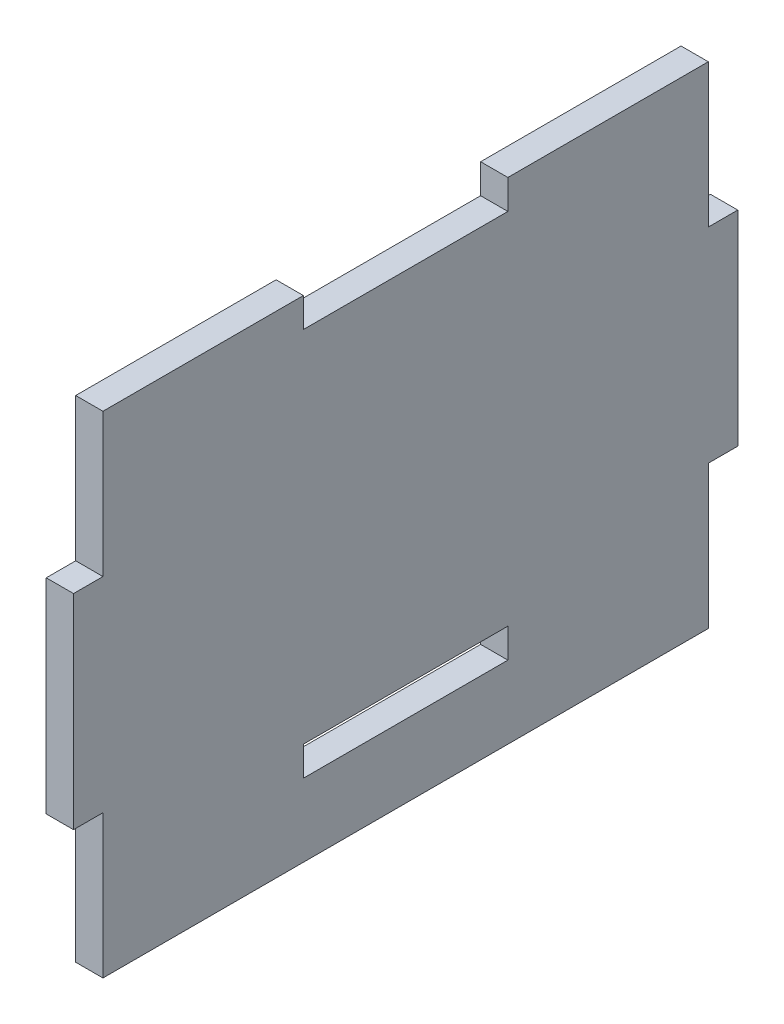
ISO-10303-21;
HEADER;
FILE_DESCRIPTION(('STEP AP214'),'2;1');
FILE_NAME('part.step','',(''),(''),'','','');
FILE_SCHEMA(('AUTOMOTIVE_DESIGN { 1 0 10303 214 1 1 1 1 }'));
ENDSEC;
DATA;
#1=APPLICATION_CONTEXT('core data for automotive mechanical design processes');
#2=APPLICATION_PROTOCOL_DEFINITION('international standard','automotive_design',2000,#1);
#3=PRODUCT_CONTEXT('',#1,'mechanical');
#4=PRODUCT('Part','Part','',(#3));
#5=PRODUCT_RELATED_PRODUCT_CATEGORY('part','',(#4));
#6=PRODUCT_DEFINITION_FORMATION('','',#4);
#7=PRODUCT_DEFINITION_CONTEXT('part definition',#1,'design');
#8=PRODUCT_DEFINITION('design','',#6,#7);
#9=PRODUCT_DEFINITION_SHAPE('','',#8);
#10=(LENGTH_UNIT() NAMED_UNIT(*) SI_UNIT(.MILLI.,.METRE.));
#11=(NAMED_UNIT(*) PLANE_ANGLE_UNIT() SI_UNIT($,.RADIAN.));
#12=(NAMED_UNIT(*) SI_UNIT($,.STERADIAN.) SOLID_ANGLE_UNIT());
#13=UNCERTAINTY_MEASURE_WITH_UNIT(LENGTH_MEASURE(1.E-05),#10,'distance_accuracy_value','');
#14=(GEOMETRIC_REPRESENTATION_CONTEXT(3) GLOBAL_UNCERTAINTY_ASSIGNED_CONTEXT((#13)) GLOBAL_UNIT_ASSIGNED_CONTEXT((#10,
#11,#12)) REPRESENTATION_CONTEXT('',''));
#15=CARTESIAN_POINT('',(0.,0.,0.));
#16=DIRECTION('',(0.,0.,1.));
#17=DIRECTION('',(1.,0.,0.));
#18=AXIS2_PLACEMENT_3D('',#15,#16,#17);
#19=CARTESIAN_POINT('',(2.54,22.86,-28.194));
#20=DIRECTION('',(0.,-1.,0.));
#21=DIRECTION('',(0.,0.,-1.));
#22=AXIS2_PLACEMENT_3D('',#19,#20,#21);
#23=PLANE('',#22);
#24=DIRECTION('',(0.,0.,1.));
#25=VECTOR('',#24,1.);
#26=CARTESIAN_POINT('',(0.,22.86,-28.194));
#27=LINE('',#26,#25);
#28=CARTESIAN_POINT('',(0.,22.86,-28.194));
#29=VERTEX_POINT('',#28);
#30=CARTESIAN_POINT('',(0.,22.86,-9.52499999999999));
#31=VERTEX_POINT('',#30);
#32=EDGE_CURVE('E186',#29,#31,#27,.T.);
#33=ORIENTED_EDGE('',*,*,#32,.T.);
#34=DIRECTION('',(1.,0.,0.));
#35=VECTOR('',#34,1.);
#36=CARTESIAN_POINT('',(0.,22.86,-9.52499999999999));
#37=LINE('',#36,#35);
#38=CARTESIAN_POINT('',(2.54,22.86,-9.52499999999999));
#39=VERTEX_POINT('',#38);
#40=EDGE_CURVE('E170',#31,#39,#37,.T.);
#41=ORIENTED_EDGE('',*,*,#40,.T.);
#42=DIRECTION('',(0.,0.,1.));
#43=VECTOR('',#42,1.);
#44=CARTESIAN_POINT('',(2.54,22.86,-28.194));
#45=LINE('',#44,#43);
#46=CARTESIAN_POINT('',(2.54,22.86,-28.194));
#47=VERTEX_POINT('',#46);
#48=EDGE_CURVE('E206',#47,#39,#45,.T.);
#49=ORIENTED_EDGE('',*,*,#48,.F.);
#50=DIRECTION('',(-1.,0.,0.));
#51=VECTOR('',#50,1.);
#52=CARTESIAN_POINT('',(2.54,22.86,-28.194));
#53=LINE('',#52,#51);
#54=EDGE_CURVE('E193',#47,#29,#53,.T.);
#55=ORIENTED_EDGE('',*,*,#54,.T.);
#56=EDGE_LOOP('',(#33,#41,#49,#55));
#57=FACE_BOUND('',#56,.T.);
#58=ADVANCED_FACE('F33',(#57),#23,.F.);
#59=CARTESIAN_POINT('',(2.54,-22.86,-28.194));
#60=DIRECTION('',(0.,0.,1.));
#61=DIRECTION('',(1.,0.,0.));
#62=AXIS2_PLACEMENT_3D('',#59,#60,#61);
#63=PLANE('',#62);
#64=DIRECTION('',(1.,0.,0.));
#65=VECTOR('',#64,1.);
#66=CARTESIAN_POINT('',(-19.246496986205,9.525,-28.194));
#67=LINE('',#66,#65);
#68=CARTESIAN_POINT('',(0.,9.525,-28.194));
#69=VERTEX_POINT('',#68);
#70=CARTESIAN_POINT('',(2.54,9.525,-28.194));
#71=VERTEX_POINT('',#70);
#72=EDGE_CURVE('E271',#69,#71,#67,.T.);
#73=ORIENTED_EDGE('',*,*,#72,.F.);
#74=DIRECTION('',(0.,1.,0.));
#75=VECTOR('',#74,1.);
#76=CARTESIAN_POINT('',(0.,-22.86,-28.194));
#77=LINE('',#76,#75);
#78=EDGE_CURVE('E224',#69,#29,#77,.T.);
#79=ORIENTED_EDGE('',*,*,#78,.T.);
#80=ORIENTED_EDGE('',*,*,#54,.F.);
#81=DIRECTION('',(0.,1.,0.));
#82=VECTOR('',#81,1.);
#83=CARTESIAN_POINT('',(2.54,-22.86,-28.194));
#84=LINE('',#83,#82);
#85=EDGE_CURVE('E233',#71,#47,#84,.T.);
#86=ORIENTED_EDGE('',*,*,#85,.F.);
#87=EDGE_LOOP('',(#73,#79,#80,#86));
#88=FACE_BOUND('',#87,.T.);
#89=ADVANCED_FACE('F354',(#88),#63,.F.);
#90=CARTESIAN_POINT('',(2.54,-22.86,28.194));
#91=DIRECTION('',(0.,0.,-1.));
#92=DIRECTION('',(-1.,0.,0.));
#93=AXIS2_PLACEMENT_3D('',#90,#91,#92);
#94=PLANE('',#93);
#95=DIRECTION('',(1.,0.,0.));
#96=VECTOR('',#95,1.);
#97=CARTESIAN_POINT('',(-19.246496986205,-9.525,28.194));
#98=LINE('',#97,#96);
#99=CARTESIAN_POINT('',(0.,-9.525,28.194));
#100=VERTEX_POINT('',#99);
#101=CARTESIAN_POINT('',(2.54,-9.525,28.194));
#102=VERTEX_POINT('',#101);
#103=EDGE_CURVE('E248',#100,#102,#98,.T.);
#104=ORIENTED_EDGE('',*,*,#103,.F.);
#105=DIRECTION('',(0.,-1.,0.));
#106=VECTOR('',#105,1.);
#107=CARTESIAN_POINT('',(0.,-22.86,28.194));
#108=LINE('',#107,#106);
#109=CARTESIAN_POINT('',(0.,-22.86,28.194));
#110=VERTEX_POINT('',#109);
#111=EDGE_CURVE('E227',#100,#110,#108,.T.);
#112=ORIENTED_EDGE('',*,*,#111,.T.);
#113=DIRECTION('',(-1.,0.,0.));
#114=VECTOR('',#113,1.);
#115=CARTESIAN_POINT('',(2.54,-22.86,28.194));
#116=LINE('',#115,#114);
#117=CARTESIAN_POINT('',(2.54,-22.86,28.194));
#118=VERTEX_POINT('',#117);
#119=EDGE_CURVE('E11',#118,#110,#116,.T.);
#120=ORIENTED_EDGE('',*,*,#119,.F.);
#121=DIRECTION('',(0.,-1.,0.));
#122=VECTOR('',#121,1.);
#123=CARTESIAN_POINT('',(2.54,-22.86,28.194));
#124=LINE('',#123,#122);
#125=EDGE_CURVE('E194',#102,#118,#124,.T.);
#126=ORIENTED_EDGE('',*,*,#125,.F.);
#127=EDGE_LOOP('',(#104,#112,#120,#126));
#128=FACE_BOUND('',#127,.T.);
#129=ADVANCED_FACE('F359',(#128),#94,.F.);
#130=CARTESIAN_POINT('',(0.,22.86,28.194));
#131=VERTEX_POINT('',#130);
#132=CARTESIAN_POINT('',(0.,9.525,28.194));
#133=VERTEX_POINT('',#132);
#134=EDGE_CURVE('E226',#131,#133,#108,.T.);
#135=ORIENTED_EDGE('',*,*,#134,.T.);
#136=DIRECTION('',(1.,0.,0.));
#137=VECTOR('',#136,1.);
#138=CARTESIAN_POINT('',(-19.246496986205,9.525,28.194));
#139=LINE('',#138,#137);
#140=CARTESIAN_POINT('',(2.54,9.525,28.194));
#141=VERTEX_POINT('',#140);
#142=EDGE_CURVE('E241',#133,#141,#139,.T.);
#143=ORIENTED_EDGE('',*,*,#142,.T.);
#144=CARTESIAN_POINT('',(2.54,22.86,28.194));
#145=VERTEX_POINT('',#144);
#146=EDGE_CURVE('E197',#145,#141,#124,.T.);
#147=ORIENTED_EDGE('',*,*,#146,.F.);
#148=DIRECTION('',(-1.,0.,0.));
#149=VECTOR('',#148,1.);
#150=CARTESIAN_POINT('',(2.54,22.86,28.194));
#151=LINE('',#150,#149);
#152=EDGE_CURVE('E203',#145,#131,#151,.T.);
#153=ORIENTED_EDGE('',*,*,#152,.T.);
#154=EDGE_LOOP('',(#135,#143,#147,#153));
#155=FACE_BOUND('',#154,.T.);
#156=ADVANCED_FACE('F35',(#155),#94,.F.);
#157=CARTESIAN_POINT('',(2.54,-22.86,-28.194));
#158=DIRECTION('',(0.,1.,0.));
#159=DIRECTION('',(0.,0.,1.));
#160=AXIS2_PLACEMENT_3D('',#157,#158,#159);
#161=PLANE('',#160);
#162=DIRECTION('',(0.,0.,-1.));
#163=VECTOR('',#162,1.);
#164=CARTESIAN_POINT('',(0.,-22.86,-28.194));
#165=LINE('',#164,#163);
#166=CARTESIAN_POINT('',(0.,-22.86,-28.194));
#167=VERTEX_POINT('',#166);
#168=EDGE_CURVE('E220',#110,#167,#165,.T.);
#169=ORIENTED_EDGE('',*,*,#168,.T.);
#170=DIRECTION('',(-1.,0.,0.));
#171=VECTOR('',#170,1.);
#172=CARTESIAN_POINT('',(2.54,-22.86,-28.194));
#173=LINE('',#172,#171);
#174=CARTESIAN_POINT('',(2.54,-22.86,-28.194));
#175=VERTEX_POINT('',#174);
#176=EDGE_CURVE('E41',#175,#167,#173,.T.);
#177=ORIENTED_EDGE('',*,*,#176,.F.);
#178=DIRECTION('',(0.,0.,-1.));
#179=VECTOR('',#178,1.);
#180=CARTESIAN_POINT('',(2.54,-22.86,-28.194));
#181=LINE('',#180,#179);
#182=EDGE_CURVE('E234',#118,#175,#181,.T.);
#183=ORIENTED_EDGE('',*,*,#182,.F.);
#184=ORIENTED_EDGE('',*,*,#119,.T.);
#185=EDGE_LOOP('',(#169,#177,#183,#184));
#186=FACE_BOUND('',#185,.T.);
#187=ADVANCED_FACE('F368',(#186),#161,.F.);
#188=CARTESIAN_POINT('',(0.,-9.525,-28.194));
#189=VERTEX_POINT('',#188);
#190=EDGE_CURVE('E199',#167,#189,#77,.T.);
#191=ORIENTED_EDGE('',*,*,#190,.T.);
#192=DIRECTION('',(1.,0.,0.));
#193=VECTOR('',#192,1.);
#194=CARTESIAN_POINT('',(-19.246496986205,-9.525,-28.194));
#195=LINE('',#194,#193);
#196=CARTESIAN_POINT('',(2.54,-9.525,-28.194));
#197=VERTEX_POINT('',#196);
#198=EDGE_CURVE('E264',#189,#197,#195,.T.);
#199=ORIENTED_EDGE('',*,*,#198,.T.);
#200=EDGE_CURVE('E215',#175,#197,#84,.T.);
#201=ORIENTED_EDGE('',*,*,#200,.F.);
#202=ORIENTED_EDGE('',*,*,#176,.T.);
#203=EDGE_LOOP('',(#191,#199,#201,#202));
#204=FACE_BOUND('',#203,.T.);
#205=ADVANCED_FACE('F212',(#204),#63,.F.);
#206=CARTESIAN_POINT('',(2.54,22.86,9.52500000000001));
#207=VERTEX_POINT('',#206);
#208=EDGE_CURVE('E231',#207,#145,#45,.T.);
#209=ORIENTED_EDGE('',*,*,#208,.F.);
#210=DIRECTION('',(1.,0.,0.));
#211=VECTOR('',#210,1.);
#212=CARTESIAN_POINT('',(0.,22.86,9.52500000000001));
#213=LINE('',#212,#211);
#214=CARTESIAN_POINT('',(0.,22.86,9.52500000000001));
#215=VERTEX_POINT('',#214);
#216=EDGE_CURVE('E180',#215,#207,#213,.T.);
#217=ORIENTED_EDGE('',*,*,#216,.F.);
#218=EDGE_CURVE('E195',#215,#131,#27,.T.);
#219=ORIENTED_EDGE('',*,*,#218,.T.);
#220=ORIENTED_EDGE('',*,*,#152,.F.);
#221=EDGE_LOOP('',(#209,#217,#219,#220));
#222=FACE_BOUND('',#221,.T.);
#223=ADVANCED_FACE('F335',(#222),#23,.F.);
#224=CARTESIAN_POINT('',(2.54,0.,0.));
#225=DIRECTION('',(1.,0.,0.));
#226=DIRECTION('',(0.,0.,-1.));
#227=AXIS2_PLACEMENT_3D('',#224,#225,#226);
#228=PLANE('',#227);
#229=DIRECTION('',(0.,1.,0.));
#230=VECTOR('',#229,1.);
#231=CARTESIAN_POINT('',(2.54,20.1168,-9.52499999999999));
#232=LINE('',#231,#230);
#233=CARTESIAN_POINT('',(2.54,20.1168,-9.52499999999999));
#234=VERTEX_POINT('',#233);
#235=EDGE_CURVE('E175',#234,#39,#232,.T.);
#236=ORIENTED_EDGE('',*,*,#235,.F.);
#237=DIRECTION('',(0.,0.,-1.));
#238=VECTOR('',#237,1.);
#239=CARTESIAN_POINT('',(2.54,20.1168,9.52500000000001));
#240=LINE('',#239,#238);
#241=CARTESIAN_POINT('',(2.54,20.1168,9.52500000000001));
#242=VERTEX_POINT('',#241);
#243=EDGE_CURVE('E189',#242,#234,#240,.T.);
#244=ORIENTED_EDGE('',*,*,#243,.F.);
#245=DIRECTION('',(0.,-1.,0.));
#246=VECTOR('',#245,1.);
#247=CARTESIAN_POINT('',(2.54,20.1168,9.52500000000001));
#248=LINE('',#247,#246);
#249=EDGE_CURVE('E322',#207,#242,#248,.T.);
#250=ORIENTED_EDGE('',*,*,#249,.F.);
#251=ORIENTED_EDGE('',*,*,#208,.T.);
#252=ORIENTED_EDGE('',*,*,#146,.T.);
#253=DIRECTION('',(0.,0.,1.));
#254=VECTOR('',#253,1.);
#255=CARTESIAN_POINT('',(2.54,9.525,30.9372));
#256=LINE('',#255,#254);
#257=CARTESIAN_POINT('',(2.54,9.525,30.9372));
#258=VERTEX_POINT('',#257);
#259=EDGE_CURVE('E257',#141,#258,#256,.T.);
#260=ORIENTED_EDGE('',*,*,#259,.T.);
#261=DIRECTION('',(0.,-1.,0.));
#262=VECTOR('',#261,1.);
#263=CARTESIAN_POINT('',(2.54,9.525,30.9372));
#264=LINE('',#263,#262);
#265=CARTESIAN_POINT('',(2.54,-9.525,30.9372));
#266=VERTEX_POINT('',#265);
#267=EDGE_CURVE('E254',#258,#266,#264,.T.);
#268=ORIENTED_EDGE('',*,*,#267,.T.);
#269=DIRECTION('',(0.,0.,-1.));
#270=VECTOR('',#269,1.);
#271=CARTESIAN_POINT('',(2.54,-9.525,30.9372));
#272=LINE('',#271,#270);
#273=EDGE_CURVE('E244',#266,#102,#272,.T.);
#274=ORIENTED_EDGE('',*,*,#273,.T.);
#275=ORIENTED_EDGE('',*,*,#125,.T.);
#276=ORIENTED_EDGE('',*,*,#182,.T.);
#277=ORIENTED_EDGE('',*,*,#200,.T.);
#278=DIRECTION('',(0.,0.,-1.));
#279=VECTOR('',#278,1.);
#280=CARTESIAN_POINT('',(2.54,-9.525,-30.9372));
#281=LINE('',#280,#279);
#282=CARTESIAN_POINT('',(2.54,-9.525,-30.9372));
#283=VERTEX_POINT('',#282);
#284=EDGE_CURVE('E280',#197,#283,#281,.T.);
#285=ORIENTED_EDGE('',*,*,#284,.T.);
#286=DIRECTION('',(0.,1.,0.));
#287=VECTOR('',#286,1.);
#288=CARTESIAN_POINT('',(2.54,9.525,-30.9372));
#289=LINE('',#288,#287);
#290=CARTESIAN_POINT('',(2.54,9.525,-30.9372));
#291=VERTEX_POINT('',#290);
#292=EDGE_CURVE('E277',#283,#291,#289,.T.);
#293=ORIENTED_EDGE('',*,*,#292,.T.);
#294=DIRECTION('',(0.,0.,1.));
#295=VECTOR('',#294,1.);
#296=CARTESIAN_POINT('',(2.54,9.525,-30.9372));
#297=LINE('',#296,#295);
#298=EDGE_CURVE('E267',#291,#71,#297,.T.);
#299=ORIENTED_EDGE('',*,*,#298,.T.);
#300=ORIENTED_EDGE('',*,*,#85,.T.);
#301=ORIENTED_EDGE('',*,*,#48,.T.);
#302=EDGE_LOOP('',(#236,#244,#250,#251,#252,#260,#268,#274,#275,#276,#277,#285,#293,#299,#300,#301));
#303=FACE_BOUND('',#302,.T.);
#304=DIRECTION('',(0.,-1.,0.));
#305=VECTOR('',#304,1.);
#306=CARTESIAN_POINT('',(2.54,-13.335,9.525));
#307=LINE('',#306,#305);
#308=CARTESIAN_POINT('',(2.54,-13.335,9.525));
#309=VERTEX_POINT('',#308);
#310=CARTESIAN_POINT('',(2.54,-16.0782,9.525));
#311=VERTEX_POINT('',#310);
#312=EDGE_CURVE('E48',#309,#311,#307,.T.);
#313=ORIENTED_EDGE('',*,*,#312,.F.);
#314=DIRECTION('',(0.,0.,1.));
#315=VECTOR('',#314,1.);
#316=CARTESIAN_POINT('',(2.54,-13.335,-9.525));
#317=LINE('',#316,#315);
#318=CARTESIAN_POINT('',(2.54,-13.335,-9.525));
#319=VERTEX_POINT('',#318);
#320=EDGE_CURVE('E295',#319,#309,#317,.T.);
#321=ORIENTED_EDGE('',*,*,#320,.F.);
#322=DIRECTION('',(0.,1.,0.));
#323=VECTOR('',#322,1.);
#324=CARTESIAN_POINT('',(2.54,-13.335,-9.525));
#325=LINE('',#324,#323);
#326=CARTESIAN_POINT('',(2.54,-16.0782,-9.525));
#327=VERTEX_POINT('',#326);
#328=EDGE_CURVE('E299',#327,#319,#325,.T.);
#329=ORIENTED_EDGE('',*,*,#328,.F.);
#330=DIRECTION('',(0.,0.,-1.));
#331=VECTOR('',#330,1.);
#332=CARTESIAN_POINT('',(2.54,-16.0782,-9.525));
#333=LINE('',#332,#331);
#334=EDGE_CURVE('E302',#311,#327,#333,.T.);
#335=ORIENTED_EDGE('',*,*,#334,.F.);
#336=EDGE_LOOP('',(#313,#321,#329,#335));
#337=FACE_BOUND('',#336,.T.);
#338=ADVANCED_FACE('F339',(#303,#337),#228,.T.);
#339=CARTESIAN_POINT('',(0.,0.,0.));
#340=DIRECTION('',(1.,0.,0.));
#341=DIRECTION('',(0.,0.,-1.));
#342=AXIS2_PLACEMENT_3D('',#339,#340,#341);
#343=PLANE('',#342);
#344=DIRECTION('',(0.,0.,1.));
#345=VECTOR('',#344,1.);
#346=CARTESIAN_POINT('',(0.,-13.335,-9.525));
#347=LINE('',#346,#345);
#348=CARTESIAN_POINT('',(0.,-13.335,-9.525));
#349=VERTEX_POINT('',#348);
#350=CARTESIAN_POINT('',(0.,-13.335,9.525));
#351=VERTEX_POINT('',#350);
#352=EDGE_CURVE('E289',#349,#351,#347,.T.);
#353=ORIENTED_EDGE('',*,*,#352,.T.);
#354=DIRECTION('',(0.,-1.,0.));
#355=VECTOR('',#354,1.);
#356=CARTESIAN_POINT('',(0.,-13.335,9.525));
#357=LINE('',#356,#355);
#358=CARTESIAN_POINT('',(0.,-16.0782,9.525));
#359=VERTEX_POINT('',#358);
#360=EDGE_CURVE('E298',#351,#359,#357,.T.);
#361=ORIENTED_EDGE('',*,*,#360,.T.);
#362=DIRECTION('',(0.,0.,-1.));
#363=VECTOR('',#362,1.);
#364=CARTESIAN_POINT('',(0.,-16.0782,-9.525));
#365=LINE('',#364,#363);
#366=CARTESIAN_POINT('',(0.,-16.0782,-9.525));
#367=VERTEX_POINT('',#366);
#368=EDGE_CURVE('E311',#359,#367,#365,.T.);
#369=ORIENTED_EDGE('',*,*,#368,.T.);
#370=DIRECTION('',(0.,1.,0.));
#371=VECTOR('',#370,1.);
#372=CARTESIAN_POINT('',(0.,-13.335,-9.525));
#373=LINE('',#372,#371);
#374=EDGE_CURVE('E308',#367,#349,#373,.T.);
#375=ORIENTED_EDGE('',*,*,#374,.T.);
#376=EDGE_LOOP('',(#353,#361,#369,#375));
#377=FACE_BOUND('',#376,.T.);
#378=DIRECTION('',(0.,0.,-1.));
#379=VECTOR('',#378,1.);
#380=CARTESIAN_POINT('',(0.,20.1168,9.52500000000001));
#381=LINE('',#380,#379);
#382=CARTESIAN_POINT('',(0.,20.1168,9.52500000000001));
#383=VERTEX_POINT('',#382);
#384=CARTESIAN_POINT('',(0.,20.1168,-9.52499999999999));
#385=VERTEX_POINT('',#384);
#386=EDGE_CURVE('E56',#383,#385,#381,.T.);
#387=ORIENTED_EDGE('',*,*,#386,.T.);
#388=DIRECTION('',(0.,1.,0.));
#389=VECTOR('',#388,1.);
#390=CARTESIAN_POINT('',(0.,20.1168,-9.52499999999999));
#391=LINE('',#390,#389);
#392=EDGE_CURVE('E173',#385,#31,#391,.T.);
#393=ORIENTED_EDGE('',*,*,#392,.T.);
#394=ORIENTED_EDGE('',*,*,#32,.F.);
#395=ORIENTED_EDGE('',*,*,#78,.F.);
#396=DIRECTION('',(0.,0.,-1.));
#397=VECTOR('',#396,1.);
#398=CARTESIAN_POINT('',(0.,9.525,-30.9372));
#399=LINE('',#398,#397);
#400=CARTESIAN_POINT('',(0.,9.525,-30.9372));
#401=VERTEX_POINT('',#400);
#402=EDGE_CURVE('E263',#69,#401,#399,.T.);
#403=ORIENTED_EDGE('',*,*,#402,.T.);
#404=DIRECTION('',(0.,-1.,0.));
#405=VECTOR('',#404,1.);
#406=CARTESIAN_POINT('',(0.,9.525,-30.9372));
#407=LINE('',#406,#405);
#408=CARTESIAN_POINT('',(0.,-9.525,-30.9372));
#409=VERTEX_POINT('',#408);
#410=EDGE_CURVE('E274',#401,#409,#407,.T.);
#411=ORIENTED_EDGE('',*,*,#410,.T.);
#412=DIRECTION('',(0.,0.,1.));
#413=VECTOR('',#412,1.);
#414=CARTESIAN_POINT('',(0.,-9.525,-30.9372));
#415=LINE('',#414,#413);
#416=EDGE_CURVE('E222',#409,#189,#415,.T.);
#417=ORIENTED_EDGE('',*,*,#416,.T.);
#418=ORIENTED_EDGE('',*,*,#190,.F.);
#419=ORIENTED_EDGE('',*,*,#168,.F.);
#420=ORIENTED_EDGE('',*,*,#111,.F.);
#421=DIRECTION('',(0.,0.,1.));
#422=VECTOR('',#421,1.);
#423=CARTESIAN_POINT('',(0.,-9.525,30.9372));
#424=LINE('',#423,#422);
#425=CARTESIAN_POINT('',(0.,-9.525,30.9372));
#426=VERTEX_POINT('',#425);
#427=EDGE_CURVE('E240',#100,#426,#424,.T.);
#428=ORIENTED_EDGE('',*,*,#427,.T.);
#429=DIRECTION('',(0.,1.,0.));
#430=VECTOR('',#429,1.);
#431=CARTESIAN_POINT('',(0.,9.525,30.9372));
#432=LINE('',#431,#430);
#433=CARTESIAN_POINT('',(0.,9.525,30.9372));
#434=VERTEX_POINT('',#433);
#435=EDGE_CURVE('E251',#426,#434,#432,.T.);
#436=ORIENTED_EDGE('',*,*,#435,.T.);
#437=DIRECTION('',(0.,0.,-1.));
#438=VECTOR('',#437,1.);
#439=CARTESIAN_POINT('',(0.,9.525,30.9372));
#440=LINE('',#439,#438);
#441=EDGE_CURVE('E237',#434,#133,#440,.T.);
#442=ORIENTED_EDGE('',*,*,#441,.T.);
#443=ORIENTED_EDGE('',*,*,#134,.F.);
#444=ORIENTED_EDGE('',*,*,#218,.F.);
#445=DIRECTION('',(0.,-1.,0.));
#446=VECTOR('',#445,1.);
#447=CARTESIAN_POINT('',(0.,20.1168,9.52500000000001));
#448=LINE('',#447,#446);
#449=EDGE_CURVE('E188',#215,#383,#448,.T.);
#450=ORIENTED_EDGE('',*,*,#449,.T.);
#451=EDGE_LOOP('',(#387,#393,#394,#395,#403,#411,#417,#418,#419,#420,#428,#436,#442,#443,#444,#450));
#452=FACE_BOUND('',#451,.T.);
#453=ADVANCED_FACE('F184',(#377,#452),#343,.F.);
#454=CARTESIAN_POINT('',(-19.246496986205,-9.525,30.9372));
#455=DIRECTION('',(0.,-1.,0.));
#456=DIRECTION('',(0.,0.,-1.));
#457=AXIS2_PLACEMENT_3D('',#454,#455,#456);
#458=PLANE('',#457);
#459=ORIENTED_EDGE('',*,*,#427,.F.);
#460=ORIENTED_EDGE('',*,*,#103,.T.);
#461=ORIENTED_EDGE('',*,*,#273,.F.);
#462=DIRECTION('',(1.,0.,0.));
#463=VECTOR('',#462,1.);
#464=CARTESIAN_POINT('',(-19.246496986205,-9.525,30.9372));
#465=LINE('',#464,#463);
#466=EDGE_CURVE('E246',#426,#266,#465,.T.);
#467=ORIENTED_EDGE('',*,*,#466,.F.);
#468=EDGE_LOOP('',(#459,#460,#461,#467));
#469=FACE_BOUND('',#468,.T.);
#470=ADVANCED_FACE('F392',(#469),#458,.T.);
#471=CARTESIAN_POINT('',(-19.246496986205,9.525,30.9372));
#472=DIRECTION('',(0.,0.,1.));
#473=DIRECTION('',(1.,0.,0.));
#474=AXIS2_PLACEMENT_3D('',#471,#472,#473);
#475=PLANE('',#474);
#476=ORIENTED_EDGE('',*,*,#435,.F.);
#477=ORIENTED_EDGE('',*,*,#466,.T.);
#478=ORIENTED_EDGE('',*,*,#267,.F.);
#479=DIRECTION('',(1.,0.,0.));
#480=VECTOR('',#479,1.);
#481=CARTESIAN_POINT('',(-19.246496986205,9.525,30.9372));
#482=LINE('',#481,#480);
#483=EDGE_CURVE('E243',#434,#258,#482,.T.);
#484=ORIENTED_EDGE('',*,*,#483,.F.);
#485=EDGE_LOOP('',(#476,#477,#478,#484));
#486=FACE_BOUND('',#485,.T.);
#487=ADVANCED_FACE('F394',(#486),#475,.T.);
#488=CARTESIAN_POINT('',(-19.246496986205,9.525,30.9372));
#489=DIRECTION('',(0.,1.,0.));
#490=DIRECTION('',(0.,0.,1.));
#491=AXIS2_PLACEMENT_3D('',#488,#489,#490);
#492=PLANE('',#491);
#493=ORIENTED_EDGE('',*,*,#441,.F.);
#494=ORIENTED_EDGE('',*,*,#483,.T.);
#495=ORIENTED_EDGE('',*,*,#259,.F.);
#496=ORIENTED_EDGE('',*,*,#142,.F.);
#497=EDGE_LOOP('',(#493,#494,#495,#496));
#498=FACE_BOUND('',#497,.T.);
#499=ADVANCED_FACE('F385',(#498),#492,.T.);
#500=CARTESIAN_POINT('',(-19.246496986205,9.525,-30.9372));
#501=DIRECTION('',(0.,1.,0.));
#502=DIRECTION('',(0.,0.,1.));
#503=AXIS2_PLACEMENT_3D('',#500,#501,#502);
#504=PLANE('',#503);
#505=ORIENTED_EDGE('',*,*,#402,.F.);
#506=ORIENTED_EDGE('',*,*,#72,.T.);
#507=ORIENTED_EDGE('',*,*,#298,.F.);
#508=DIRECTION('',(1.,0.,0.));
#509=VECTOR('',#508,1.);
#510=CARTESIAN_POINT('',(-19.246496986205,9.525,-30.9372));
#511=LINE('',#510,#509);
#512=EDGE_CURVE('E269',#401,#291,#511,.T.);
#513=ORIENTED_EDGE('',*,*,#512,.F.);
#514=EDGE_LOOP('',(#505,#506,#507,#513));
#515=FACE_BOUND('',#514,.T.);
#516=ADVANCED_FACE('F401',(#515),#504,.T.);
#517=CARTESIAN_POINT('',(-19.246496986205,9.525,-30.9372));
#518=DIRECTION('',(0.,0.,-1.));
#519=DIRECTION('',(0.,1.,0.));
#520=AXIS2_PLACEMENT_3D('',#517,#518,#519);
#521=PLANE('',#520);
#522=ORIENTED_EDGE('',*,*,#410,.F.);
#523=ORIENTED_EDGE('',*,*,#512,.T.);
#524=ORIENTED_EDGE('',*,*,#292,.F.);
#525=DIRECTION('',(1.,0.,0.));
#526=VECTOR('',#525,1.);
#527=CARTESIAN_POINT('',(-19.246496986205,-9.525,-30.9372));
#528=LINE('',#527,#526);
#529=EDGE_CURVE('E266',#409,#283,#528,.T.);
#530=ORIENTED_EDGE('',*,*,#529,.F.);
#531=EDGE_LOOP('',(#522,#523,#524,#530));
#532=FACE_BOUND('',#531,.T.);
#533=ADVANCED_FACE('F436',(#532),#521,.T.);
#534=CARTESIAN_POINT('',(-19.246496986205,-9.525,-30.9372));
#535=DIRECTION('',(0.,-1.,0.));
#536=DIRECTION('',(0.,0.,-1.));
#537=AXIS2_PLACEMENT_3D('',#534,#535,#536);
#538=PLANE('',#537);
#539=ORIENTED_EDGE('',*,*,#416,.F.);
#540=ORIENTED_EDGE('',*,*,#529,.T.);
#541=ORIENTED_EDGE('',*,*,#284,.F.);
#542=ORIENTED_EDGE('',*,*,#198,.F.);
#543=EDGE_LOOP('',(#539,#540,#541,#542));
#544=FACE_BOUND('',#543,.T.);
#545=ADVANCED_FACE('F433',(#544),#538,.T.);
#546=CARTESIAN_POINT('',(0.,-13.335,9.525));
#547=DIRECTION('',(0.,0.,1.));
#548=DIRECTION('',(1.,0.,0.));
#549=AXIS2_PLACEMENT_3D('',#546,#547,#548);
#550=PLANE('',#549);
#551=ORIENTED_EDGE('',*,*,#312,.T.);
#552=DIRECTION('',(1.,0.,0.));
#553=VECTOR('',#552,1.);
#554=CARTESIAN_POINT('',(0.,-16.0782,9.525));
#555=LINE('',#554,#553);
#556=EDGE_CURVE('E286',#359,#311,#555,.T.);
#557=ORIENTED_EDGE('',*,*,#556,.F.);
#558=ORIENTED_EDGE('',*,*,#360,.F.);
#559=DIRECTION('',(1.,0.,0.));
#560=VECTOR('',#559,1.);
#561=CARTESIAN_POINT('',(0.,-13.335,9.525));
#562=LINE('',#561,#560);
#563=EDGE_CURVE('E293',#351,#309,#562,.T.);
#564=ORIENTED_EDGE('',*,*,#563,.T.);
#565=EDGE_LOOP('',(#551,#557,#558,#564));
#566=FACE_BOUND('',#565,.T.);
#567=ADVANCED_FACE('F414',(#566),#550,.F.);
#568=CARTESIAN_POINT('',(0.,-13.335,-9.525));
#569=DIRECTION('',(0.,1.,0.));
#570=DIRECTION('',(0.,0.,1.));
#571=AXIS2_PLACEMENT_3D('',#568,#569,#570);
#572=PLANE('',#571);
#573=ORIENTED_EDGE('',*,*,#320,.T.);
#574=ORIENTED_EDGE('',*,*,#563,.F.);
#575=ORIENTED_EDGE('',*,*,#352,.F.);
#576=DIRECTION('',(1.,0.,0.));
#577=VECTOR('',#576,1.);
#578=CARTESIAN_POINT('',(0.,-13.335,-9.525));
#579=LINE('',#578,#577);
#580=EDGE_CURVE('E291',#349,#319,#579,.T.);
#581=ORIENTED_EDGE('',*,*,#580,.T.);
#582=EDGE_LOOP('',(#573,#574,#575,#581));
#583=FACE_BOUND('',#582,.T.);
#584=ADVANCED_FACE('F412',(#583),#572,.F.);
#585=CARTESIAN_POINT('',(0.,-13.335,-9.525));
#586=DIRECTION('',(0.,0.,-1.));
#587=DIRECTION('',(-1.,0.,0.));
#588=AXIS2_PLACEMENT_3D('',#585,#586,#587);
#589=PLANE('',#588);
#590=ORIENTED_EDGE('',*,*,#328,.T.);
#591=ORIENTED_EDGE('',*,*,#580,.F.);
#592=ORIENTED_EDGE('',*,*,#374,.F.);
#593=DIRECTION('',(1.,0.,0.));
#594=VECTOR('',#593,1.);
#595=CARTESIAN_POINT('',(0.,-16.0782,-9.525));
#596=LINE('',#595,#594);
#597=EDGE_CURVE('E288',#367,#327,#596,.T.);
#598=ORIENTED_EDGE('',*,*,#597,.T.);
#599=EDGE_LOOP('',(#590,#591,#592,#598));
#600=FACE_BOUND('',#599,.T.);
#601=ADVANCED_FACE('F421',(#600),#589,.F.);
#602=CARTESIAN_POINT('',(0.,-16.0782,-9.525));
#603=DIRECTION('',(0.,-1.,0.));
#604=DIRECTION('',(0.,0.,-1.));
#605=AXIS2_PLACEMENT_3D('',#602,#603,#604);
#606=PLANE('',#605);
#607=ORIENTED_EDGE('',*,*,#334,.T.);
#608=ORIENTED_EDGE('',*,*,#597,.F.);
#609=ORIENTED_EDGE('',*,*,#368,.F.);
#610=ORIENTED_EDGE('',*,*,#556,.T.);
#611=EDGE_LOOP('',(#607,#608,#609,#610));
#612=FACE_BOUND('',#611,.T.);
#613=ADVANCED_FACE('F351',(#612),#606,.F.);
#614=CARTESIAN_POINT('',(0.,20.1168,-9.52499999999999));
#615=DIRECTION('',(0.,0.,-1.));
#616=DIRECTION('',(-1.,0.,0.));
#617=AXIS2_PLACEMENT_3D('',#614,#615,#616);
#618=PLANE('',#617);
#619=ORIENTED_EDGE('',*,*,#235,.T.);
#620=ORIENTED_EDGE('',*,*,#40,.F.);
#621=ORIENTED_EDGE('',*,*,#392,.F.);
#622=DIRECTION('',(1.,0.,0.));
#623=VECTOR('',#622,1.);
#624=CARTESIAN_POINT('',(0.,20.1168,-9.52499999999999));
#625=LINE('',#624,#623);
#626=EDGE_CURVE('E283',#385,#234,#625,.T.);
#627=ORIENTED_EDGE('',*,*,#626,.T.);
#628=EDGE_LOOP('',(#619,#620,#621,#627));
#629=FACE_BOUND('',#628,.T.);
#630=ADVANCED_FACE('F172',(#629),#618,.F.);
#631=CARTESIAN_POINT('',(0.,20.1168,9.52500000000001));
#632=DIRECTION('',(0.,-1.,0.));
#633=DIRECTION('',(0.,0.,-1.));
#634=AXIS2_PLACEMENT_3D('',#631,#632,#633);
#635=PLANE('',#634);
#636=ORIENTED_EDGE('',*,*,#243,.T.);
#637=ORIENTED_EDGE('',*,*,#626,.F.);
#638=ORIENTED_EDGE('',*,*,#386,.F.);
#639=DIRECTION('',(1.,0.,0.));
#640=VECTOR('',#639,1.);
#641=CARTESIAN_POINT('',(0.,20.1168,9.52500000000001));
#642=LINE('',#641,#640);
#643=EDGE_CURVE('E317',#383,#242,#642,.T.);
#644=ORIENTED_EDGE('',*,*,#643,.T.);
#645=EDGE_LOOP('',(#636,#637,#638,#644));
#646=FACE_BOUND('',#645,.T.);
#647=ADVANCED_FACE('F343',(#646),#635,.F.);
#648=CARTESIAN_POINT('',(0.,20.1168,9.52500000000001));
#649=DIRECTION('',(0.,0.,1.));
#650=DIRECTION('',(1.,0.,0.));
#651=AXIS2_PLACEMENT_3D('',#648,#649,#650);
#652=PLANE('',#651);
#653=ORIENTED_EDGE('',*,*,#249,.T.);
#654=ORIENTED_EDGE('',*,*,#643,.F.);
#655=ORIENTED_EDGE('',*,*,#449,.F.);
#656=ORIENTED_EDGE('',*,*,#216,.T.);
#657=EDGE_LOOP('',(#653,#654,#655,#656));
#658=FACE_BOUND('',#657,.T.);
#659=ADVANCED_FACE('F331',(#658),#652,.F.);
#660=CLOSED_SHELL('',(#58,#89,#129,#156,#187,#205,#223,#338,#453,#470,#487,#499,#516,#533,#545,
#567,#584,#601,#613,#630,#647,#659));
#661=MANIFOLD_SOLID_BREP('B2',#660);
#662=ADVANCED_BREP_SHAPE_REPRESENTATION('',(#18,#661),#14);
#663=SHAPE_DEFINITION_REPRESENTATION(#9,#662);
ENDSEC;
END-ISO-10303-21;
